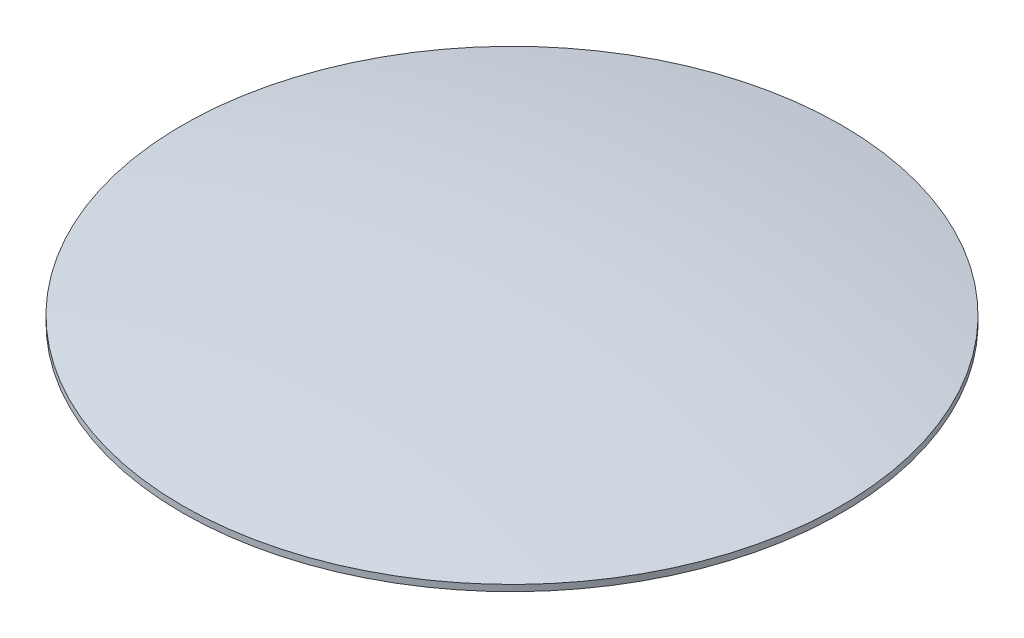
ISO-10303-21;
HEADER;
FILE_DESCRIPTION(('STEP AP214'),'2;1');
FILE_NAME('part.step','',(''),(''),'','','');
FILE_SCHEMA(('AUTOMOTIVE_DESIGN { 1 0 10303 214 1 1 1 1 }'));
ENDSEC;
DATA;
#1=APPLICATION_CONTEXT('core data for automotive mechanical design processes');
#2=APPLICATION_PROTOCOL_DEFINITION('international standard','automotive_design',2000,#1);
#3=PRODUCT_CONTEXT('',#1,'mechanical');
#4=PRODUCT('Part','Part','',(#3));
#5=PRODUCT_RELATED_PRODUCT_CATEGORY('part','',(#4));
#6=PRODUCT_DEFINITION_FORMATION('','',#4);
#7=PRODUCT_DEFINITION_CONTEXT('part definition',#1,'design');
#8=PRODUCT_DEFINITION('design','',#6,#7);
#9=PRODUCT_DEFINITION_SHAPE('','',#8);
#10=(LENGTH_UNIT() NAMED_UNIT(*) SI_UNIT(.MILLI.,.METRE.));
#11=(NAMED_UNIT(*) PLANE_ANGLE_UNIT() SI_UNIT($,.RADIAN.));
#12=(NAMED_UNIT(*) SI_UNIT($,.STERADIAN.) SOLID_ANGLE_UNIT());
#13=UNCERTAINTY_MEASURE_WITH_UNIT(LENGTH_MEASURE(1.E-05),#10,'distance_accuracy_value','');
#14=(GEOMETRIC_REPRESENTATION_CONTEXT(3) GLOBAL_UNCERTAINTY_ASSIGNED_CONTEXT((#13)) GLOBAL_UNIT_ASSIGNED_CONTEXT((#10,
#11,#12)) REPRESENTATION_CONTEXT('',''));
#15=CARTESIAN_POINT('',(0.,0.,0.));
#16=DIRECTION('',(0.,0.,1.));
#17=DIRECTION('',(1.,0.,0.));
#18=AXIS2_PLACEMENT_3D('',#15,#16,#17);
#19=CARTESIAN_POINT('',(0.,0.254,0.));
#20=DIRECTION('',(0.,-1.,0.));
#21=DIRECTION('',(0.,0.,-1.));
#22=AXIS2_PLACEMENT_3D('',#19,#20,#21);
#23=CYLINDRICAL_SURFACE('',#22,13.335);
#24=CARTESIAN_POINT('',(0.,0.254,0.));
#25=DIRECTION('',(0.,1.,0.));
#26=DIRECTION('',(0.,0.,1.));
#27=AXIS2_PLACEMENT_3D('',#24,#25,#26);
#28=CIRCLE('',#27,13.335);
#29=CARTESIAN_POINT('',(0.,0.254,13.335));
#30=VERTEX_POINT('',#29);
#31=EDGE_CURVE('E10',#30,#30,#28,.T.);
#32=ORIENTED_EDGE('',*,*,#31,.F.);
#33=EDGE_LOOP('',(#32));
#34=FACE_BOUND('',#33,.T.);
#35=CARTESIAN_POINT('',(0.,0.,0.));
#36=DIRECTION('',(0.,1.,0.));
#37=DIRECTION('',(0.,0.,1.));
#38=AXIS2_PLACEMENT_3D('',#35,#36,#37);
#39=CIRCLE('',#38,13.335);
#40=CARTESIAN_POINT('',(0.,0.,13.335));
#41=VERTEX_POINT('',#40);
#42=EDGE_CURVE('E37',#41,#41,#39,.T.);
#43=ORIENTED_EDGE('',*,*,#42,.T.);
#44=EDGE_LOOP('',(#43));
#45=FACE_BOUND('',#44,.T.);
#46=ADVANCED_FACE('F30',(#34,#45),#23,.T.);
#47=CARTESIAN_POINT('',(0.,-69.11975,0.));
#48=DIRECTION('',(0.,0.,1.));
#49=DIRECTION('',(1.,0.,0.));
#50=AXIS2_PLACEMENT_3D('',#47,#48,#49);
#51=SPHERICAL_SURFACE('',#50,70.64375);
#52=CARTESIAN_POINT('',(0.,-69.11975,0.));
#53=DIRECTION('',(0.,1.,0.));
#54=DIRECTION('',(0.,0.,1.));
#55=AXIS2_PLACEMENT_3D('',#52,#53,#54);
#56=SPHERICAL_SURFACE('',#55,70.64375);
#57=ORIENTED_EDGE('',*,*,#31,.T.);
#58=EDGE_LOOP('',(#57));
#59=FACE_BOUND('',#58,.T.);
#60=ADVANCED_FACE('F32',(#59),#56,.T.);
#61=CARTESIAN_POINT('',(0.,0.,0.));
#62=DIRECTION('',(0.,1.,0.));
#63=DIRECTION('',(0.,0.,1.));
#64=AXIS2_PLACEMENT_3D('',#61,#62,#63);
#65=PLANE('',#64);
#66=ORIENTED_EDGE('',*,*,#42,.F.);
#67=EDGE_LOOP('',(#66));
#68=FACE_BOUND('',#67,.T.);
#69=ADVANCED_FACE('F44',(#68),#65,.F.);
#70=CLOSED_SHELL('',(#46,#60,#69));
#71=MANIFOLD_SOLID_BREP('B2',#70);
#72=ADVANCED_BREP_SHAPE_REPRESENTATION('',(#18,#71),#14);
#73=SHAPE_DEFINITION_REPRESENTATION(#9,#72);
ENDSEC;
END-ISO-10303-21;
